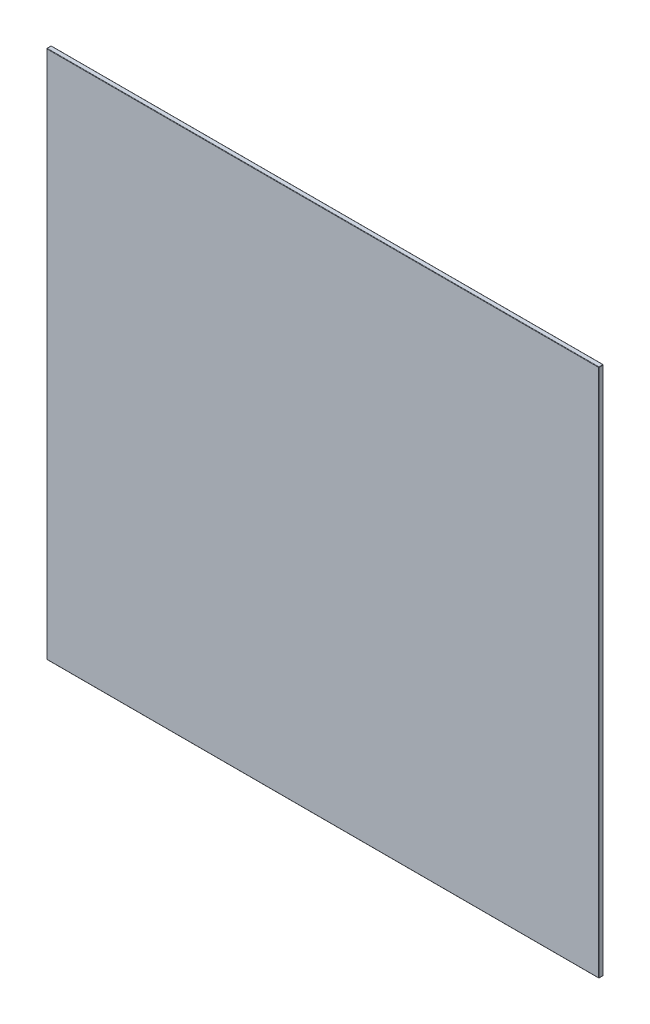
ISO-10303-21;
HEADER;
FILE_DESCRIPTION(('STEP AP214'),'2;1');
FILE_NAME('part.step','',(''),(''),'','','');
FILE_SCHEMA(('AUTOMOTIVE_DESIGN { 1 0 10303 214 1 1 1 1 }'));
ENDSEC;
DATA;
#1=APPLICATION_CONTEXT('core data for automotive mechanical design processes');
#2=APPLICATION_PROTOCOL_DEFINITION('international standard','automotive_design',2000,#1);
#3=PRODUCT_CONTEXT('',#1,'mechanical');
#4=PRODUCT('Part','Part','',(#3));
#5=PRODUCT_RELATED_PRODUCT_CATEGORY('part','',(#4));
#6=PRODUCT_DEFINITION_FORMATION('','',#4);
#7=PRODUCT_DEFINITION_CONTEXT('part definition',#1,'design');
#8=PRODUCT_DEFINITION('design','',#6,#7);
#9=PRODUCT_DEFINITION_SHAPE('','',#8);
#10=(LENGTH_UNIT() NAMED_UNIT(*) SI_UNIT(.MILLI.,.METRE.));
#11=(NAMED_UNIT(*) PLANE_ANGLE_UNIT() SI_UNIT($,.RADIAN.));
#12=(NAMED_UNIT(*) SI_UNIT($,.STERADIAN.) SOLID_ANGLE_UNIT());
#13=UNCERTAINTY_MEASURE_WITH_UNIT(LENGTH_MEASURE(1.E-05),#10,'distance_accuracy_value','');
#14=(GEOMETRIC_REPRESENTATION_CONTEXT(3) GLOBAL_UNCERTAINTY_ASSIGNED_CONTEXT((#13)) GLOBAL_UNIT_ASSIGNED_CONTEXT((#10,
#11,#12)) REPRESENTATION_CONTEXT('',''));
#15=CARTESIAN_POINT('',(0.,0.,0.));
#16=DIRECTION('',(0.,0.,1.));
#17=DIRECTION('',(1.,0.,0.));
#18=AXIS2_PLACEMENT_3D('',#15,#16,#17);
#19=CARTESIAN_POINT('',(180.,-172.5,3.));
#20=DIRECTION('',(-1.,0.,0.));
#21=DIRECTION('',(0.,0.,1.));
#22=AXIS2_PLACEMENT_3D('',#19,#20,#21);
#23=PLANE('',#22);
#24=DIRECTION('',(0.,0.,-1.));
#25=VECTOR('',#24,1.);
#26=CARTESIAN_POINT('',(180.,172.25,3.));
#27=LINE('',#26,#25);
#28=CARTESIAN_POINT('',(180.,172.25,0.25));
#29=VERTEX_POINT('',#28);
#30=CARTESIAN_POINT('',(180.,172.25,2.75));
#31=VERTEX_POINT('',#30);
#32=EDGE_CURVE('E215',#29,#31,#27,.F.);
#33=ORIENTED_EDGE('',*,*,#32,.T.);
#34=DIRECTION('',(0.,1.,0.));
#35=VECTOR('',#34,1.);
#36=CARTESIAN_POINT('',(180.,-172.5,2.75));
#37=LINE('',#36,#35);
#38=CARTESIAN_POINT('',(180.,-172.25,2.75));
#39=VERTEX_POINT('',#38);
#40=EDGE_CURVE('E218',#31,#39,#37,.F.);
#41=ORIENTED_EDGE('',*,*,#40,.T.);
#42=DIRECTION('',(0.,0.,-1.));
#43=VECTOR('',#42,1.);
#44=CARTESIAN_POINT('',(180.,-172.25,3.));
#45=LINE('',#44,#43);
#46=CARTESIAN_POINT('',(180.,-172.25,0.25));
#47=VERTEX_POINT('',#46);
#48=EDGE_CURVE('E216',#39,#47,#45,.T.);
#49=ORIENTED_EDGE('',*,*,#48,.T.);
#50=DIRECTION('',(0.,1.,0.));
#51=VECTOR('',#50,1.);
#52=CARTESIAN_POINT('',(180.,172.5,0.25));
#53=LINE('',#52,#51);
#54=EDGE_CURVE('E212',#47,#29,#53,.T.);
#55=ORIENTED_EDGE('',*,*,#54,.T.);
#56=EDGE_LOOP('',(#33,#41,#49,#55));
#57=FACE_BOUND('',#56,.T.);
#58=ADVANCED_FACE('F33',(#57),#23,.F.);
#59=CARTESIAN_POINT('',(-180.,172.5,3.));
#60=DIRECTION('',(0.,-1.,0.));
#61=DIRECTION('',(0.,0.,-1.));
#62=AXIS2_PLACEMENT_3D('',#59,#60,#61);
#63=PLANE('',#62);
#64=DIRECTION('',(-1.,0.,0.));
#65=VECTOR('',#64,1.);
#66=CARTESIAN_POINT('',(-180.,172.5,2.75));
#67=LINE('',#66,#65);
#68=CARTESIAN_POINT('',(-179.75,172.5,2.75));
#69=VERTEX_POINT('',#68);
#70=CARTESIAN_POINT('',(179.75,172.5,2.75));
#71=VERTEX_POINT('',#70);
#72=EDGE_CURVE('E265',#69,#71,#67,.F.);
#73=ORIENTED_EDGE('',*,*,#72,.T.);
#74=DIRECTION('',(0.,0.,-1.));
#75=VECTOR('',#74,1.);
#76=CARTESIAN_POINT('',(179.75,172.5,3.));
#77=LINE('',#76,#75);
#78=CARTESIAN_POINT('',(179.75,172.5,0.25));
#79=VERTEX_POINT('',#78);
#80=EDGE_CURVE('E259',#71,#79,#77,.T.);
#81=ORIENTED_EDGE('',*,*,#80,.T.);
#82=DIRECTION('',(-1.,0.,0.));
#83=VECTOR('',#82,1.);
#84=CARTESIAN_POINT('',(-180.,172.5,0.25));
#85=LINE('',#84,#83);
#86=CARTESIAN_POINT('',(-179.75,172.5,0.25));
#87=VERTEX_POINT('',#86);
#88=EDGE_CURVE('E274',#79,#87,#85,.T.);
#89=ORIENTED_EDGE('',*,*,#88,.T.);
#90=DIRECTION('',(0.,0.,-1.));
#91=VECTOR('',#90,1.);
#92=CARTESIAN_POINT('',(-179.75,172.5,3.));
#93=LINE('',#92,#91);
#94=EDGE_CURVE('E270',#87,#69,#93,.F.);
#95=ORIENTED_EDGE('',*,*,#94,.T.);
#96=EDGE_LOOP('',(#73,#81,#89,#95));
#97=FACE_BOUND('',#96,.T.);
#98=ADVANCED_FACE('F268',(#97),#63,.F.);
#99=CARTESIAN_POINT('',(-180.,-172.5,3.));
#100=DIRECTION('',(1.,0.,0.));
#101=DIRECTION('',(0.,0.,-1.));
#102=AXIS2_PLACEMENT_3D('',#99,#100,#101);
#103=PLANE('',#102);
#104=DIRECTION('',(0.,-1.,0.));
#105=VECTOR('',#104,1.);
#106=CARTESIAN_POINT('',(-180.,-172.5,2.75));
#107=LINE('',#106,#105);
#108=CARTESIAN_POINT('',(-180.,-172.25,2.75));
#109=VERTEX_POINT('',#108);
#110=CARTESIAN_POINT('',(-180.,172.25,2.75));
#111=VERTEX_POINT('',#110);
#112=EDGE_CURVE('E152',#109,#111,#107,.F.);
#113=ORIENTED_EDGE('',*,*,#112,.T.);
#114=DIRECTION('',(0.,0.,-1.));
#115=VECTOR('',#114,1.);
#116=CARTESIAN_POINT('',(-180.,172.25,3.));
#117=LINE('',#116,#115);
#118=CARTESIAN_POINT('',(-180.,172.25,0.25));
#119=VERTEX_POINT('',#118);
#120=EDGE_CURVE('E231',#111,#119,#117,.T.);
#121=ORIENTED_EDGE('',*,*,#120,.T.);
#122=DIRECTION('',(0.,-1.,0.));
#123=VECTOR('',#122,1.);
#124=CARTESIAN_POINT('',(-180.,-172.5,0.25));
#125=LINE('',#124,#123);
#126=CARTESIAN_POINT('',(-180.,-172.25,0.25));
#127=VERTEX_POINT('',#126);
#128=EDGE_CURVE('E228',#119,#127,#125,.T.);
#129=ORIENTED_EDGE('',*,*,#128,.T.);
#130=DIRECTION('',(0.,0.,-1.));
#131=VECTOR('',#130,1.);
#132=CARTESIAN_POINT('',(-180.,-172.25,3.));
#133=LINE('',#132,#131);
#134=EDGE_CURVE('E226',#127,#109,#133,.F.);
#135=ORIENTED_EDGE('',*,*,#134,.T.);
#136=EDGE_LOOP('',(#113,#121,#129,#135));
#137=FACE_BOUND('',#136,.T.);
#138=ADVANCED_FACE('F327',(#137),#103,.F.);
#139=CARTESIAN_POINT('',(-180.,-172.5,3.));
#140=DIRECTION('',(0.,1.,0.));
#141=DIRECTION('',(0.,0.,1.));
#142=AXIS2_PLACEMENT_3D('',#139,#140,#141);
#143=PLANE('',#142);
#144=DIRECTION('',(1.,0.,0.));
#145=VECTOR('',#144,1.);
#146=CARTESIAN_POINT('',(-180.,-172.5,2.75));
#147=LINE('',#146,#145);
#148=CARTESIAN_POINT('',(179.75,-172.5,2.75));
#149=VERTEX_POINT('',#148);
#150=CARTESIAN_POINT('',(-179.75,-172.5,2.75));
#151=VERTEX_POINT('',#150);
#152=EDGE_CURVE('E42',#149,#151,#147,.F.);
#153=ORIENTED_EDGE('',*,*,#152,.T.);
#154=DIRECTION('',(0.,0.,-1.));
#155=VECTOR('',#154,1.);
#156=CARTESIAN_POINT('',(-179.75,-172.5,3.));
#157=LINE('',#156,#155);
#158=CARTESIAN_POINT('',(-179.75,-172.5,0.25));
#159=VERTEX_POINT('',#158);
#160=EDGE_CURVE('E11',#151,#159,#157,.T.);
#161=ORIENTED_EDGE('',*,*,#160,.T.);
#162=DIRECTION('',(1.,0.,0.));
#163=VECTOR('',#162,1.);
#164=CARTESIAN_POINT('',(180.,-172.5,0.25));
#165=LINE('',#164,#163);
#166=CARTESIAN_POINT('',(179.75,-172.5,0.25));
#167=VERTEX_POINT('',#166);
#168=EDGE_CURVE('E234',#159,#167,#165,.T.);
#169=ORIENTED_EDGE('',*,*,#168,.T.);
#170=DIRECTION('',(0.,0.,-1.));
#171=VECTOR('',#170,1.);
#172=CARTESIAN_POINT('',(179.75,-172.5,3.));
#173=LINE('',#172,#171);
#174=EDGE_CURVE('E53',#167,#149,#173,.F.);
#175=ORIENTED_EDGE('',*,*,#174,.T.);
#176=EDGE_LOOP('',(#153,#161,#169,#175));
#177=FACE_BOUND('',#176,.T.);
#178=ADVANCED_FACE('F489',(#177),#143,.F.);
#179=CARTESIAN_POINT('',(0.,0.,3.));
#180=DIRECTION('',(0.,0.,-1.));
#181=DIRECTION('',(-1.,0.,0.));
#182=AXIS2_PLACEMENT_3D('',#179,#180,#181);
#183=PLANE('',#182);
#184=DIRECTION('',(0.,1.,0.));
#185=VECTOR('',#184,1.);
#186=CARTESIAN_POINT('',(179.75,0.,3.));
#187=LINE('',#186,#185);
#188=CARTESIAN_POINT('',(179.75,-172.25,3.));
#189=VERTEX_POINT('',#188);
#190=CARTESIAN_POINT('',(179.75,172.25,3.));
#191=VERTEX_POINT('',#190);
#192=EDGE_CURVE('E131',#189,#191,#187,.T.);
#193=ORIENTED_EDGE('',*,*,#192,.T.);
#194=DIRECTION('',(-1.,0.,0.));
#195=VECTOR('',#194,1.);
#196=CARTESIAN_POINT('',(0.,172.25,3.));
#197=LINE('',#196,#195);
#198=CARTESIAN_POINT('',(-179.75,172.25,3.));
#199=VERTEX_POINT('',#198);
#200=EDGE_CURVE('E127',#191,#199,#197,.T.);
#201=ORIENTED_EDGE('',*,*,#200,.T.);
#202=DIRECTION('',(0.,-1.,0.));
#203=VECTOR('',#202,1.);
#204=CARTESIAN_POINT('',(-179.75,0.,3.));
#205=LINE('',#204,#203);
#206=CARTESIAN_POINT('',(-179.75,-172.25,3.));
#207=VERTEX_POINT('',#206);
#208=EDGE_CURVE('E121',#199,#207,#205,.T.);
#209=ORIENTED_EDGE('',*,*,#208,.T.);
#210=DIRECTION('',(1.,0.,0.));
#211=VECTOR('',#210,1.);
#212=CARTESIAN_POINT('',(0.,-172.25,3.));
#213=LINE('',#212,#211);
#214=EDGE_CURVE('E124',#207,#189,#213,.T.);
#215=ORIENTED_EDGE('',*,*,#214,.T.);
#216=EDGE_LOOP('',(#193,#201,#209,#215));
#217=FACE_BOUND('',#216,.T.);
#218=ADVANCED_FACE('F123',(#217),#183,.F.);
#219=CARTESIAN_POINT('',(0.,0.,0.));
#220=DIRECTION('',(0.,0.,-1.));
#221=DIRECTION('',(-1.,0.,0.));
#222=AXIS2_PLACEMENT_3D('',#219,#220,#221);
#223=PLANE('',#222);
#224=DIRECTION('',(0.,-1.,0.));
#225=VECTOR('',#224,1.);
#226=CARTESIAN_POINT('',(-179.75,172.5,0.));
#227=LINE('',#226,#225);
#228=CARTESIAN_POINT('',(-179.75,-172.25,0.));
#229=VERTEX_POINT('',#228);
#230=CARTESIAN_POINT('',(-179.75,172.25,0.));
#231=VERTEX_POINT('',#230);
#232=EDGE_CURVE('E280',#229,#231,#227,.F.);
#233=ORIENTED_EDGE('',*,*,#232,.T.);
#234=DIRECTION('',(-1.,0.,0.));
#235=VECTOR('',#234,1.);
#236=CARTESIAN_POINT('',(180.,172.25,0.));
#237=LINE('',#236,#235);
#238=CARTESIAN_POINT('',(179.75,172.25,0.));
#239=VERTEX_POINT('',#238);
#240=EDGE_CURVE('E220',#231,#239,#237,.F.);
#241=ORIENTED_EDGE('',*,*,#240,.T.);
#242=DIRECTION('',(0.,1.,0.));
#243=VECTOR('',#242,1.);
#244=CARTESIAN_POINT('',(179.75,-172.5,0.));
#245=LINE('',#244,#243);
#246=CARTESIAN_POINT('',(179.75,-172.25,0.));
#247=VERTEX_POINT('',#246);
#248=EDGE_CURVE('E210',#239,#247,#245,.F.);
#249=ORIENTED_EDGE('',*,*,#248,.T.);
#250=DIRECTION('',(1.,0.,0.));
#251=VECTOR('',#250,1.);
#252=CARTESIAN_POINT('',(-180.,-172.25,0.));
#253=LINE('',#252,#251);
#254=EDGE_CURVE('E264',#247,#229,#253,.F.);
#255=ORIENTED_EDGE('',*,*,#254,.T.);
#256=EDGE_LOOP('',(#233,#241,#249,#255));
#257=FACE_BOUND('',#256,.T.);
#258=ADVANCED_FACE('F284',(#257),#223,.T.);
#259=CARTESIAN_POINT('',(-180.,-172.25,0.25));
#260=DIRECTION('',(-1.,0.,0.));
#261=DIRECTION('',(0.,0.,1.));
#262=AXIS2_PLACEMENT_3D('',#259,#260,#261);
#263=CYLINDRICAL_SURFACE('',#262,0.25);
#264=CARTESIAN_POINT('',(179.75,-172.25,0.25));
#265=DIRECTION('',(1.,0.,0.));
#266=DIRECTION('',(0.,0.,-1.));
#267=AXIS2_PLACEMENT_3D('',#264,#265,#266);
#268=CIRCLE('',#267,0.25);
#269=EDGE_CURVE('E37',#167,#247,#268,.T.);
#270=ORIENTED_EDGE('',*,*,#269,.F.);
#271=ORIENTED_EDGE('',*,*,#168,.F.);
#272=CARTESIAN_POINT('',(-179.75,-172.25,0.25));
#273=DIRECTION('',(-1.,0.,0.));
#274=DIRECTION('',(0.,0.,1.));
#275=AXIS2_PLACEMENT_3D('',#272,#273,#274);
#276=CIRCLE('',#275,0.25);
#277=EDGE_CURVE('E190',#229,#159,#276,.T.);
#278=ORIENTED_EDGE('',*,*,#277,.F.);
#279=ORIENTED_EDGE('',*,*,#254,.F.);
#280=EDGE_LOOP('',(#270,#271,#278,#279));
#281=FACE_BOUND('',#280,.T.);
#282=ADVANCED_FACE('F35',(#281),#263,.T.);
#283=CARTESIAN_POINT('',(179.75,-172.25,0.25));
#284=DIRECTION('',(0.,0.,1.));
#285=DIRECTION('',(1.,0.,0.));
#286=AXIS2_PLACEMENT_3D('',#283,#284,#285);
#287=SPHERICAL_SURFACE('',#286,0.25);
#288=CARTESIAN_POINT('',(179.75,-172.25,0.25));
#289=DIRECTION('',(0.,0.,-1.));
#290=DIRECTION('',(-1.,0.,0.));
#291=AXIS2_PLACEMENT_3D('',#288,#289,#290);
#292=CIRCLE('',#291,0.25);
#293=EDGE_CURVE('E185',#167,#47,#292,.F.);
#294=ORIENTED_EDGE('',*,*,#293,.F.);
#295=ORIENTED_EDGE('',*,*,#269,.T.);
#296=CARTESIAN_POINT('',(179.75,-172.25,0.25));
#297=DIRECTION('',(0.,-1.,0.));
#298=DIRECTION('',(0.,0.,-1.));
#299=AXIS2_PLACEMENT_3D('',#296,#297,#298);
#300=CIRCLE('',#299,0.25);
#301=EDGE_CURVE('E188',#47,#247,#300,.F.);
#302=ORIENTED_EDGE('',*,*,#301,.F.);
#303=EDGE_LOOP('',(#294,#295,#302));
#304=FACE_BOUND('',#303,.T.);
#305=ADVANCED_FACE('F202',(#304),#287,.T.);
#306=CARTESIAN_POINT('',(-179.75,-172.25,0.25));
#307=DIRECTION('',(0.,0.,1.));
#308=DIRECTION('',(1.,0.,0.));
#309=AXIS2_PLACEMENT_3D('',#306,#307,#308);
#310=SPHERICAL_SURFACE('',#309,0.25);
#311=CARTESIAN_POINT('',(-179.75,-172.25,0.25));
#312=DIRECTION('',(0.,-1.,0.));
#313=DIRECTION('',(0.,0.,-1.));
#314=AXIS2_PLACEMENT_3D('',#311,#312,#313);
#315=CIRCLE('',#314,0.25);
#316=EDGE_CURVE('E180',#229,#127,#315,.F.);
#317=ORIENTED_EDGE('',*,*,#316,.F.);
#318=ORIENTED_EDGE('',*,*,#277,.T.);
#319=CARTESIAN_POINT('',(-179.75,-172.25,0.25));
#320=DIRECTION('',(0.,0.,-1.));
#321=DIRECTION('',(-1.,0.,0.));
#322=AXIS2_PLACEMENT_3D('',#319,#320,#321);
#323=CIRCLE('',#322,0.25);
#324=EDGE_CURVE('E183',#127,#159,#323,.F.);
#325=ORIENTED_EDGE('',*,*,#324,.F.);
#326=EDGE_LOOP('',(#317,#318,#325));
#327=FACE_BOUND('',#326,.T.);
#328=ADVANCED_FACE('F455',(#327),#310,.T.);
#329=CARTESIAN_POINT('',(179.75,-172.5,0.25));
#330=DIRECTION('',(0.,-1.,0.));
#331=DIRECTION('',(0.,0.,-1.));
#332=AXIS2_PLACEMENT_3D('',#329,#330,#331);
#333=CYLINDRICAL_SURFACE('',#332,0.25);
#334=ORIENTED_EDGE('',*,*,#301,.T.);
#335=ORIENTED_EDGE('',*,*,#248,.F.);
#336=CARTESIAN_POINT('',(179.75,172.25,0.25));
#337=DIRECTION('',(0.,1.,0.));
#338=DIRECTION('',(0.,0.,1.));
#339=AXIS2_PLACEMENT_3D('',#336,#337,#338);
#340=CIRCLE('',#339,0.25);
#341=EDGE_CURVE('E175',#29,#239,#340,.T.);
#342=ORIENTED_EDGE('',*,*,#341,.F.);
#343=ORIENTED_EDGE('',*,*,#54,.F.);
#344=EDGE_LOOP('',(#334,#335,#342,#343));
#345=FACE_BOUND('',#344,.T.);
#346=ADVANCED_FACE('F208',(#345),#333,.T.);
#347=CARTESIAN_POINT('',(179.75,-172.25,3.));
#348=DIRECTION('',(0.,0.,-1.));
#349=DIRECTION('',(-1.,0.,0.));
#350=AXIS2_PLACEMENT_3D('',#347,#348,#349);
#351=CYLINDRICAL_SURFACE('',#350,0.25);
#352=ORIENTED_EDGE('',*,*,#293,.T.);
#353=ORIENTED_EDGE('',*,*,#48,.F.);
#354=CARTESIAN_POINT('',(179.75,-172.25,2.75));
#355=DIRECTION('',(0.,0.,1.));
#356=DIRECTION('',(1.,0.,0.));
#357=AXIS2_PLACEMENT_3D('',#354,#355,#356);
#358=CIRCLE('',#357,0.25);
#359=EDGE_CURVE('E172',#149,#39,#358,.T.);
#360=ORIENTED_EDGE('',*,*,#359,.F.);
#361=ORIENTED_EDGE('',*,*,#174,.F.);
#362=EDGE_LOOP('',(#352,#353,#360,#361));
#363=FACE_BOUND('',#362,.T.);
#364=ADVANCED_FACE('F309',(#363),#351,.T.);
#365=CARTESIAN_POINT('',(0.,-172.25,2.75));
#366=DIRECTION('',(1.,0.,0.));
#367=DIRECTION('',(0.,0.,-1.));
#368=AXIS2_PLACEMENT_3D('',#365,#366,#367);
#369=CYLINDRICAL_SURFACE('',#368,0.25);
#370=CARTESIAN_POINT('',(-179.75,-172.25,2.75));
#371=DIRECTION('',(-1.,0.,0.));
#372=DIRECTION('',(0.,0.,1.));
#373=AXIS2_PLACEMENT_3D('',#370,#371,#372);
#374=CIRCLE('',#373,0.25);
#375=EDGE_CURVE('E137',#151,#207,#374,.T.);
#376=ORIENTED_EDGE('',*,*,#375,.F.);
#377=ORIENTED_EDGE('',*,*,#152,.F.);
#378=CARTESIAN_POINT('',(179.75,-172.25,2.75));
#379=DIRECTION('',(1.,0.,0.));
#380=DIRECTION('',(0.,0.,-1.));
#381=AXIS2_PLACEMENT_3D('',#378,#379,#380);
#382=CIRCLE('',#381,0.25);
#383=EDGE_CURVE('E140',#189,#149,#382,.T.);
#384=ORIENTED_EDGE('',*,*,#383,.F.);
#385=ORIENTED_EDGE('',*,*,#214,.F.);
#386=EDGE_LOOP('',(#376,#377,#384,#385));
#387=FACE_BOUND('',#386,.T.);
#388=ADVANCED_FACE('F136',(#387),#369,.T.);
#389=CARTESIAN_POINT('',(-179.75,-172.25,3.));
#390=DIRECTION('',(0.,0.,-1.));
#391=DIRECTION('',(-1.,0.,0.));
#392=AXIS2_PLACEMENT_3D('',#389,#390,#391);
#393=CYLINDRICAL_SURFACE('',#392,0.25);
#394=ORIENTED_EDGE('',*,*,#324,.T.);
#395=ORIENTED_EDGE('',*,*,#160,.F.);
#396=CARTESIAN_POINT('',(-179.75,-172.25,2.75));
#397=DIRECTION('',(0.,0.,1.));
#398=DIRECTION('',(1.,0.,0.));
#399=AXIS2_PLACEMENT_3D('',#396,#397,#398);
#400=CIRCLE('',#399,0.25);
#401=EDGE_CURVE('E149',#109,#151,#400,.T.);
#402=ORIENTED_EDGE('',*,*,#401,.F.);
#403=ORIENTED_EDGE('',*,*,#134,.F.);
#404=EDGE_LOOP('',(#394,#395,#402,#403));
#405=FACE_BOUND('',#404,.T.);
#406=ADVANCED_FACE('F425',(#405),#393,.T.);
#407=CARTESIAN_POINT('',(-179.75,-172.5,0.25));
#408=DIRECTION('',(0.,1.,0.));
#409=DIRECTION('',(0.,0.,1.));
#410=AXIS2_PLACEMENT_3D('',#407,#408,#409);
#411=CYLINDRICAL_SURFACE('',#410,0.25);
#412=ORIENTED_EDGE('',*,*,#316,.T.);
#413=ORIENTED_EDGE('',*,*,#128,.F.);
#414=CARTESIAN_POINT('',(-179.75,172.25,0.25));
#415=DIRECTION('',(1.11022302462516E-13,1.,0.));
#416=DIRECTION('',(-1.,1.11022302462516E-13,0.));
#417=AXIS2_PLACEMENT_3D('',#414,#415,#416);
#418=CIRCLE('',#417,0.25);
#419=EDGE_CURVE('E167',#231,#119,#418,.T.);
#420=ORIENTED_EDGE('',*,*,#419,.F.);
#421=ORIENTED_EDGE('',*,*,#232,.F.);
#422=EDGE_LOOP('',(#412,#413,#420,#421));
#423=FACE_BOUND('',#422,.T.);
#424=ADVANCED_FACE('F294',(#423),#411,.T.);
#425=CARTESIAN_POINT('',(-180.,172.25,0.25));
#426=DIRECTION('',(1.,0.,0.));
#427=DIRECTION('',(0.,0.,-1.));
#428=AXIS2_PLACEMENT_3D('',#425,#426,#427);
#429=CYLINDRICAL_SURFACE('',#428,0.25);
#430=CARTESIAN_POINT('',(179.75,172.25,0.25));
#431=DIRECTION('',(1.,-1.11022302462516E-13,0.));
#432=DIRECTION('',(1.11022302462516E-13,1.,0.));
#433=AXIS2_PLACEMENT_3D('',#430,#431,#432);
#434=CIRCLE('',#433,0.25);
#435=EDGE_CURVE('E177',#239,#79,#434,.T.);
#436=ORIENTED_EDGE('',*,*,#435,.F.);
#437=ORIENTED_EDGE('',*,*,#240,.F.);
#438=CARTESIAN_POINT('',(-179.75,172.25,0.25));
#439=DIRECTION('',(-1.,0.,0.));
#440=DIRECTION('',(0.,0.,1.));
#441=AXIS2_PLACEMENT_3D('',#438,#439,#440);
#442=CIRCLE('',#441,0.25);
#443=EDGE_CURVE('E164',#87,#231,#442,.T.);
#444=ORIENTED_EDGE('',*,*,#443,.F.);
#445=ORIENTED_EDGE('',*,*,#88,.F.);
#446=EDGE_LOOP('',(#436,#437,#444,#445));
#447=FACE_BOUND('',#446,.T.);
#448=ADVANCED_FACE('F290',(#447),#429,.T.);
#449=CARTESIAN_POINT('',(179.75,172.25,0.25));
#450=DIRECTION('',(0.,0.,1.));
#451=DIRECTION('',(1.,0.,0.));
#452=AXIS2_PLACEMENT_3D('',#449,#450,#451);
#453=SPHERICAL_SURFACE('',#452,0.25);
#454=ORIENTED_EDGE('',*,*,#341,.T.);
#455=ORIENTED_EDGE('',*,*,#435,.T.);
#456=CARTESIAN_POINT('',(179.75,172.25,0.25));
#457=DIRECTION('',(0.,0.,-1.));
#458=DIRECTION('',(-1.,0.,0.));
#459=AXIS2_PLACEMENT_3D('',#456,#457,#458);
#460=CIRCLE('',#459,0.25);
#461=EDGE_CURVE('E156',#29,#79,#460,.F.);
#462=ORIENTED_EDGE('',*,*,#461,.F.);
#463=EDGE_LOOP('',(#454,#455,#462));
#464=FACE_BOUND('',#463,.T.);
#465=ADVANCED_FACE('F313',(#464),#453,.T.);
#466=CARTESIAN_POINT('',(179.75,-172.25,2.75));
#467=DIRECTION('',(0.,0.,1.));
#468=DIRECTION('',(1.,0.,0.));
#469=AXIS2_PLACEMENT_3D('',#466,#467,#468);
#470=SPHERICAL_SURFACE('',#469,0.25);
#471=ORIENTED_EDGE('',*,*,#383,.T.);
#472=ORIENTED_EDGE('',*,*,#359,.T.);
#473=CARTESIAN_POINT('',(179.75,-172.25,2.75));
#474=DIRECTION('',(0.,-1.,0.));
#475=DIRECTION('',(0.,0.,-1.));
#476=AXIS2_PLACEMENT_3D('',#473,#474,#475);
#477=CIRCLE('',#476,0.25);
#478=EDGE_CURVE('E153',#189,#39,#477,.F.);
#479=ORIENTED_EDGE('',*,*,#478,.F.);
#480=EDGE_LOOP('',(#471,#472,#479));
#481=FACE_BOUND('',#480,.T.);
#482=ADVANCED_FACE('F311',(#481),#470,.T.);
#483=CARTESIAN_POINT('',(-179.75,-172.25,2.75));
#484=DIRECTION('',(0.,0.,1.));
#485=DIRECTION('',(1.,0.,0.));
#486=AXIS2_PLACEMENT_3D('',#483,#484,#485);
#487=SPHERICAL_SURFACE('',#486,0.25);
#488=ORIENTED_EDGE('',*,*,#401,.T.);
#489=ORIENTED_EDGE('',*,*,#375,.T.);
#490=CARTESIAN_POINT('',(-179.75,-172.25,2.75));
#491=DIRECTION('',(0.,-1.,0.));
#492=DIRECTION('',(0.,0.,-1.));
#493=AXIS2_PLACEMENT_3D('',#490,#491,#492);
#494=CIRCLE('',#493,0.25);
#495=EDGE_CURVE('E146',#109,#207,#494,.F.);
#496=ORIENTED_EDGE('',*,*,#495,.F.);
#497=EDGE_LOOP('',(#488,#489,#496));
#498=FACE_BOUND('',#497,.T.);
#499=ADVANCED_FACE('F145',(#498),#487,.T.);
#500=CARTESIAN_POINT('',(-179.75,172.25,0.25));
#501=DIRECTION('',(0.,0.,1.));
#502=DIRECTION('',(1.,0.,0.));
#503=AXIS2_PLACEMENT_3D('',#500,#501,#502);
#504=SPHERICAL_SURFACE('',#503,0.25);
#505=ORIENTED_EDGE('',*,*,#443,.T.);
#506=ORIENTED_EDGE('',*,*,#419,.T.);
#507=CARTESIAN_POINT('',(-179.75,172.25,0.25));
#508=DIRECTION('',(0.,0.,-1.));
#509=DIRECTION('',(-1.,0.,0.));
#510=AXIS2_PLACEMENT_3D('',#507,#508,#509);
#511=CIRCLE('',#510,0.25);
#512=EDGE_CURVE('E154',#87,#119,#511,.F.);
#513=ORIENTED_EDGE('',*,*,#512,.F.);
#514=EDGE_LOOP('',(#505,#506,#513));
#515=FACE_BOUND('',#514,.T.);
#516=ADVANCED_FACE('F296',(#515),#504,.T.);
#517=CARTESIAN_POINT('',(179.75,172.25,3.));
#518=DIRECTION('',(0.,0.,-1.));
#519=DIRECTION('',(-1.,0.,0.));
#520=AXIS2_PLACEMENT_3D('',#517,#518,#519);
#521=CYLINDRICAL_SURFACE('',#520,0.25);
#522=ORIENTED_EDGE('',*,*,#461,.T.);
#523=ORIENTED_EDGE('',*,*,#80,.F.);
#524=CARTESIAN_POINT('',(179.75,172.25,2.75));
#525=DIRECTION('',(0.,0.,1.));
#526=DIRECTION('',(1.,0.,0.));
#527=AXIS2_PLACEMENT_3D('',#524,#525,#526);
#528=CIRCLE('',#527,0.25);
#529=EDGE_CURVE('E158',#31,#71,#528,.T.);
#530=ORIENTED_EDGE('',*,*,#529,.F.);
#531=ORIENTED_EDGE('',*,*,#32,.F.);
#532=EDGE_LOOP('',(#522,#523,#530,#531));
#533=FACE_BOUND('',#532,.T.);
#534=ADVANCED_FACE('F261',(#533),#521,.T.);
#535=CARTESIAN_POINT('',(179.75,0.,2.75));
#536=DIRECTION('',(0.,1.,0.));
#537=DIRECTION('',(0.,0.,1.));
#538=AXIS2_PLACEMENT_3D('',#535,#536,#537);
#539=CYLINDRICAL_SURFACE('',#538,0.25);
#540=ORIENTED_EDGE('',*,*,#478,.T.);
#541=ORIENTED_EDGE('',*,*,#40,.F.);
#542=CARTESIAN_POINT('',(179.75,172.25,2.75));
#543=DIRECTION('',(0.,1.,0.));
#544=DIRECTION('',(0.,0.,1.));
#545=AXIS2_PLACEMENT_3D('',#542,#543,#544);
#546=CIRCLE('',#545,0.25);
#547=EDGE_CURVE('E248',#191,#31,#546,.T.);
#548=ORIENTED_EDGE('',*,*,#547,.F.);
#549=ORIENTED_EDGE('',*,*,#192,.F.);
#550=EDGE_LOOP('',(#540,#541,#548,#549));
#551=FACE_BOUND('',#550,.T.);
#552=ADVANCED_FACE('F305',(#551),#539,.T.);
#553=CARTESIAN_POINT('',(-179.75,0.,2.75));
#554=DIRECTION('',(0.,-1.,0.));
#555=DIRECTION('',(0.,0.,-1.));
#556=AXIS2_PLACEMENT_3D('',#553,#554,#555);
#557=CYLINDRICAL_SURFACE('',#556,0.25);
#558=ORIENTED_EDGE('',*,*,#495,.T.);
#559=ORIENTED_EDGE('',*,*,#208,.F.);
#560=CARTESIAN_POINT('',(-179.75,172.25,2.75));
#561=DIRECTION('',(0.,1.,1.11022302462516E-13));
#562=DIRECTION('',(0.,-1.11022302462516E-13,1.));
#563=AXIS2_PLACEMENT_3D('',#560,#561,#562);
#564=CIRCLE('',#563,0.25);
#565=EDGE_CURVE('E245',#111,#199,#564,.T.);
#566=ORIENTED_EDGE('',*,*,#565,.F.);
#567=ORIENTED_EDGE('',*,*,#112,.F.);
#568=EDGE_LOOP('',(#558,#559,#566,#567));
#569=FACE_BOUND('',#568,.T.);
#570=ADVANCED_FACE('F151',(#569),#557,.T.);
#571=CARTESIAN_POINT('',(-179.75,172.25,3.));
#572=DIRECTION('',(0.,0.,-1.));
#573=DIRECTION('',(-1.,0.,0.));
#574=AXIS2_PLACEMENT_3D('',#571,#572,#573);
#575=CYLINDRICAL_SURFACE('',#574,0.25);
#576=ORIENTED_EDGE('',*,*,#512,.T.);
#577=ORIENTED_EDGE('',*,*,#120,.F.);
#578=CARTESIAN_POINT('',(-179.75,172.25,2.75));
#579=DIRECTION('',(0.,0.,1.));
#580=DIRECTION('',(1.,0.,0.));
#581=AXIS2_PLACEMENT_3D('',#578,#579,#580);
#582=CIRCLE('',#581,0.25);
#583=EDGE_CURVE('E242',#69,#111,#582,.T.);
#584=ORIENTED_EDGE('',*,*,#583,.F.);
#585=ORIENTED_EDGE('',*,*,#94,.F.);
#586=EDGE_LOOP('',(#576,#577,#584,#585));
#587=FACE_BOUND('',#586,.T.);
#588=ADVANCED_FACE('F299',(#587),#575,.T.);
#589=CARTESIAN_POINT('',(179.75,172.25,2.75));
#590=DIRECTION('',(0.,0.,1.));
#591=DIRECTION('',(1.,0.,0.));
#592=AXIS2_PLACEMENT_3D('',#589,#590,#591);
#593=SPHERICAL_SURFACE('',#592,0.25);
#594=ORIENTED_EDGE('',*,*,#547,.T.);
#595=ORIENTED_EDGE('',*,*,#529,.T.);
#596=CARTESIAN_POINT('',(179.75,172.25,2.75));
#597=DIRECTION('',(1.,0.,1.11022302462516E-13));
#598=DIRECTION('',(1.11022302462516E-13,0.,-1.));
#599=AXIS2_PLACEMENT_3D('',#596,#597,#598);
#600=CIRCLE('',#599,0.25);
#601=EDGE_CURVE('E240',#191,#71,#600,.F.);
#602=ORIENTED_EDGE('',*,*,#601,.F.);
#603=EDGE_LOOP('',(#594,#595,#602));
#604=FACE_BOUND('',#603,.T.);
#605=ADVANCED_FACE('F255',(#604),#593,.T.);
#606=CARTESIAN_POINT('',(-179.75,172.25,2.75));
#607=DIRECTION('',(0.,0.,1.));
#608=DIRECTION('',(1.,0.,0.));
#609=AXIS2_PLACEMENT_3D('',#606,#607,#608);
#610=SPHERICAL_SURFACE('',#609,0.25);
#611=ORIENTED_EDGE('',*,*,#583,.T.);
#612=ORIENTED_EDGE('',*,*,#565,.T.);
#613=CARTESIAN_POINT('',(-179.75,172.25,2.75));
#614=DIRECTION('',(-1.,0.,0.));
#615=DIRECTION('',(0.,0.,1.));
#616=AXIS2_PLACEMENT_3D('',#613,#614,#615);
#617=CIRCLE('',#616,0.25);
#618=EDGE_CURVE('E238',#69,#199,#617,.F.);
#619=ORIENTED_EDGE('',*,*,#618,.F.);
#620=EDGE_LOOP('',(#611,#612,#619));
#621=FACE_BOUND('',#620,.T.);
#622=ADVANCED_FACE('F334',(#621),#610,.T.);
#623=CARTESIAN_POINT('',(0.,172.25,2.75));
#624=DIRECTION('',(-1.,0.,0.));
#625=DIRECTION('',(0.,0.,1.));
#626=AXIS2_PLACEMENT_3D('',#623,#624,#625);
#627=CYLINDRICAL_SURFACE('',#626,0.25);
#628=ORIENTED_EDGE('',*,*,#601,.T.);
#629=ORIENTED_EDGE('',*,*,#72,.F.);
#630=ORIENTED_EDGE('',*,*,#618,.T.);
#631=ORIENTED_EDGE('',*,*,#200,.F.);
#632=EDGE_LOOP('',(#628,#629,#630,#631));
#633=FACE_BOUND('',#632,.T.);
#634=ADVANCED_FACE('F331',(#633),#627,.T.);
#635=CLOSED_SHELL('',(#58,#98,#138,#178,#218,#258,#282,#305,#328,#346,#364,#388,#406,#424,#448,
#465,#482,#499,#516,#534,#552,#570,#588,#605,#622,#634));
#636=MANIFOLD_SOLID_BREP('B2',#635);
#637=ADVANCED_BREP_SHAPE_REPRESENTATION('',(#18,#636),#14);
#638=SHAPE_DEFINITION_REPRESENTATION(#9,#637);
ENDSEC;
END-ISO-10303-21;
